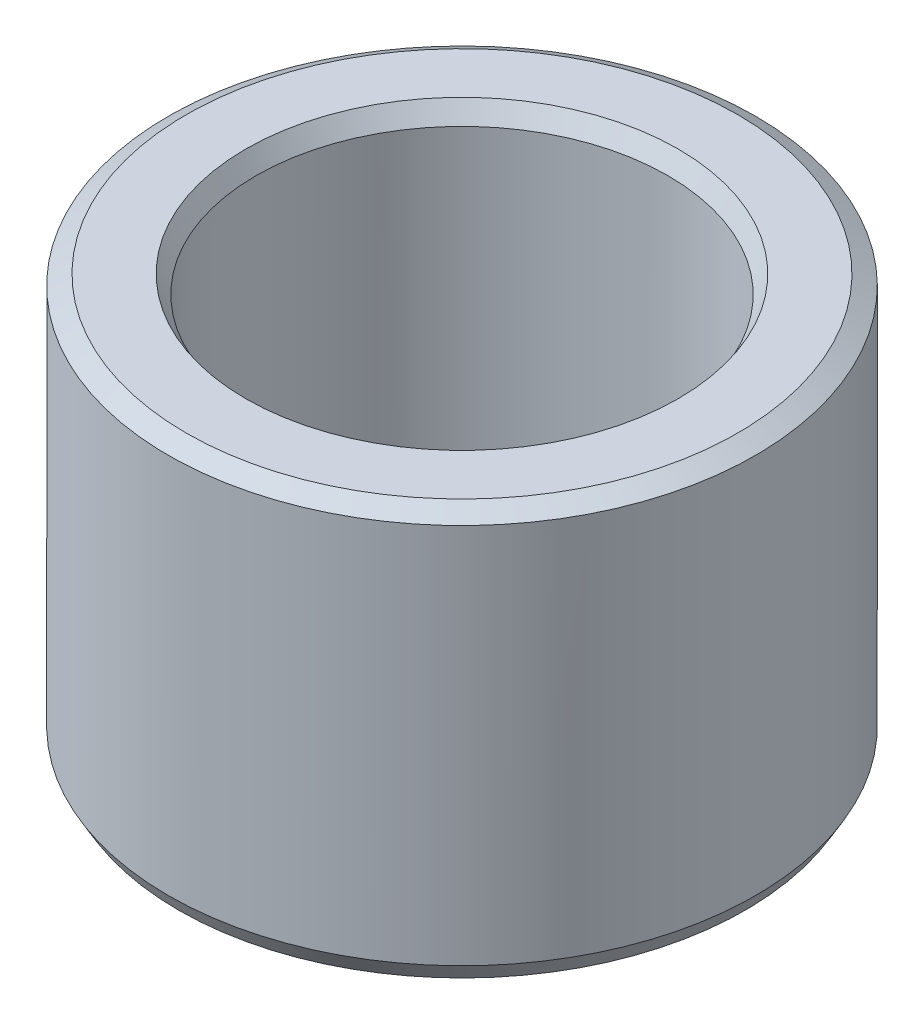
ISO-10303-21;
HEADER;
FILE_DESCRIPTION(('STEP AP214'),'2;1');
FILE_NAME('part.step','',(''),(''),'','','');
FILE_SCHEMA(('AUTOMOTIVE_DESIGN { 1 0 10303 214 1 1 1 1 }'));
ENDSEC;
DATA;
#1=APPLICATION_CONTEXT('core data for automotive mechanical design processes');
#2=APPLICATION_PROTOCOL_DEFINITION('international standard','automotive_design',2000,#1);
#3=PRODUCT_CONTEXT('',#1,'mechanical');
#4=PRODUCT('Part','Part','',(#3));
#5=PRODUCT_RELATED_PRODUCT_CATEGORY('part','',(#4));
#6=PRODUCT_DEFINITION_FORMATION('','',#4);
#7=PRODUCT_DEFINITION_CONTEXT('part definition',#1,'design');
#8=PRODUCT_DEFINITION('design','',#6,#7);
#9=PRODUCT_DEFINITION_SHAPE('','',#8);
#10=(LENGTH_UNIT() NAMED_UNIT(*) SI_UNIT(.MILLI.,.METRE.));
#11=(NAMED_UNIT(*) PLANE_ANGLE_UNIT() SI_UNIT($,.RADIAN.));
#12=(NAMED_UNIT(*) SI_UNIT($,.STERADIAN.) SOLID_ANGLE_UNIT());
#13=UNCERTAINTY_MEASURE_WITH_UNIT(LENGTH_MEASURE(1.E-05),#10,'distance_accuracy_value','');
#14=(GEOMETRIC_REPRESENTATION_CONTEXT(3) GLOBAL_UNCERTAINTY_ASSIGNED_CONTEXT((#13)) GLOBAL_UNIT_ASSIGNED_CONTEXT((#10,
#11,#12)) REPRESENTATION_CONTEXT('',''));
#15=CARTESIAN_POINT('',(0.,0.,0.));
#16=DIRECTION('',(0.,0.,1.));
#17=DIRECTION('',(1.,0.,0.));
#18=AXIS2_PLACEMENT_3D('',#15,#16,#17);
#19=CARTESIAN_POINT('',(0.,76.6838179556978,0.));
#20=DIRECTION('',(0.,-1.,0.));
#21=DIRECTION('',(0.,0.,-1.));
#22=AXIS2_PLACEMENT_3D('',#19,#20,#21);
#23=CYLINDRICAL_SURFACE('',#22,55.);
#24=CARTESIAN_POINT('',(0.,3.35095476548825,0.));
#25=DIRECTION('',(0.,1.,0.));
#26=DIRECTION('',(0.,0.,1.));
#27=AXIS2_PLACEMENT_3D('',#24,#25,#26);
#28=CIRCLE('',#27,55.);
#29=CARTESIAN_POINT('',(0.,3.35095476548825,55.));
#30=VERTEX_POINT('',#29);
#31=EDGE_CURVE('E10',#30,#30,#28,.T.);
#32=ORIENTED_EDGE('',*,*,#31,.T.);
#33=EDGE_LOOP('',(#32));
#34=FACE_BOUND('',#33,.T.);
#35=CARTESIAN_POINT('',(0.,74.7491433198009,0.));
#36=DIRECTION('',(0.,1.,0.));
#37=DIRECTION('',(0.,0.,1.));
#38=AXIS2_PLACEMENT_3D('',#35,#36,#37);
#39=CIRCLE('',#38,55.);
#40=CARTESIAN_POINT('',(0.,74.7491433198009,-55.));
#41=VERTEX_POINT('',#40);
#42=EDGE_CURVE('E50',#41,#41,#39,.F.);
#43=ORIENTED_EDGE('',*,*,#42,.T.);
#44=EDGE_LOOP('',(#43));
#45=FACE_BOUND('',#44,.T.);
#46=ADVANCED_FACE('F39',(#34,#45),#23,.T.);
#47=CARTESIAN_POINT('',(0.,76.6838179556978,0.));
#48=DIRECTION('',(0.,1.,0.));
#49=DIRECTION('',(0.,0.,1.));
#50=AXIS2_PLACEMENT_3D('',#47,#48,#49);
#51=PLANE('',#50);
#52=CARTESIAN_POINT('',(0.,76.6838179556978,0.));
#53=DIRECTION('',(0.,1.,0.));
#54=DIRECTION('',(0.,0.,1.));
#55=AXIS2_PLACEMENT_3D('',#52,#53,#54);
#56=CIRCLE('',#55,40.5009742766207);
#57=CARTESIAN_POINT('',(0.,76.6838179556978,40.5009742766207));
#58=VERTEX_POINT('',#57);
#59=EDGE_CURVE('E58',#58,#58,#56,.F.);
#60=ORIENTED_EDGE('',*,*,#59,.T.);
#61=EDGE_LOOP('',(#60));
#62=FACE_BOUND('',#61,.T.);
#63=CARTESIAN_POINT('',(0.,76.6838179556978,0.));
#64=DIRECTION('',(0.,1.,0.));
#65=DIRECTION('',(0.,0.,1.));
#66=AXIS2_PLACEMENT_3D('',#63,#64,#65);
#67=CIRCLE('',#66,51.6490452345117);
#68=CARTESIAN_POINT('',(0.,76.6838179556978,-51.6490452345117));
#69=VERTEX_POINT('',#68);
#70=EDGE_CURVE('E61',#69,#69,#67,.T.);
#71=ORIENTED_EDGE('',*,*,#70,.T.);
#72=EDGE_LOOP('',(#71));
#73=FACE_BOUND('',#72,.T.);
#74=ADVANCED_FACE('F88',(#62,#73),#51,.T.);
#75=CARTESIAN_POINT('',(0.,0.,0.));
#76=DIRECTION('',(0.,1.,0.));
#77=DIRECTION('',(0.,0.,1.));
#78=AXIS2_PLACEMENT_3D('',#75,#76,#77);
#79=PLANE('',#78);
#80=CARTESIAN_POINT('',(0.,0.,0.));
#81=DIRECTION('',(0.,1.,0.));
#82=DIRECTION('',(0.,0.,1.));
#83=AXIS2_PLACEMENT_3D('',#80,#81,#82);
#84=CIRCLE('',#83,41.917254406212);
#85=CARTESIAN_POINT('',(0.,0.,-41.917254406212));
#86=VERTEX_POINT('',#85);
#87=EDGE_CURVE('E51',#86,#86,#84,.T.);
#88=ORIENTED_EDGE('',*,*,#87,.T.);
#89=EDGE_LOOP('',(#88));
#90=FACE_BOUND('',#89,.T.);
#91=CARTESIAN_POINT('',(0.,0.,0.));
#92=DIRECTION('',(0.,1.,0.));
#93=DIRECTION('',(0.,0.,1.));
#94=AXIS2_PLACEMENT_3D('',#91,#92,#93);
#95=CIRCLE('',#94,53.0653253641031);
#96=CARTESIAN_POINT('',(0.,0.,53.0653253641031));
#97=VERTEX_POINT('',#96);
#98=EDGE_CURVE('E54',#97,#97,#95,.F.);
#99=ORIENTED_EDGE('',*,*,#98,.T.);
#100=EDGE_LOOP('',(#99));
#101=FACE_BOUND('',#100,.T.);
#102=ADVANCED_FACE('F83',(#90,#101),#79,.F.);
#103=CARTESIAN_POINT('',(0.,76.6838179556978,0.));
#104=DIRECTION('',(0.,-1.,0.));
#105=DIRECTION('',(0.,0.,-1.));
#106=AXIS2_PLACEMENT_3D('',#103,#104,#105);
#107=CYLINDRICAL_SURFACE('',#106,38.5662996407237);
#108=CARTESIAN_POINT('',(0.,73.3328631902095,0.));
#109=DIRECTION('',(0.,1.,0.));
#110=DIRECTION('',(0.,0.,1.));
#111=AXIS2_PLACEMENT_3D('',#108,#109,#110);
#112=CIRCLE('',#111,38.5662996407237);
#113=CARTESIAN_POINT('',(0.,73.3328631902095,38.5662996407237));
#114=VERTEX_POINT('',#113);
#115=EDGE_CURVE('E67',#114,#114,#112,.T.);
#116=ORIENTED_EDGE('',*,*,#115,.T.);
#117=EDGE_LOOP('',(#116));
#118=FACE_BOUND('',#117,.T.);
#119=CARTESIAN_POINT('',(0.,1.93467463589693,0.));
#120=DIRECTION('',(0.,1.,0.));
#121=DIRECTION('',(0.,0.,1.));
#122=AXIS2_PLACEMENT_3D('',#119,#120,#121);
#123=CIRCLE('',#122,38.5662996407237);
#124=CARTESIAN_POINT('',(0.,1.93467463589693,-38.5662996407237));
#125=VERTEX_POINT('',#124);
#126=EDGE_CURVE('E69',#125,#125,#123,.F.);
#127=ORIENTED_EDGE('',*,*,#126,.T.);
#128=EDGE_LOOP('',(#127));
#129=FACE_BOUND('',#128,.T.);
#130=ADVANCED_FACE('F71',(#118,#129),#107,.F.);
#131=CARTESIAN_POINT('',(0.,73.3328631902095,0.));
#132=DIRECTION('',(0.,1.,0.));
#133=DIRECTION('',(0.,0.,1.));
#134=AXIS2_PLACEMENT_3D('',#131,#132,#133);
#135=CONICAL_SURFACE('',#134,38.5662996407237,0.523598775598299);
#136=ORIENTED_EDGE('',*,*,#59,.F.);
#137=EDGE_LOOP('',(#136));
#138=FACE_BOUND('',#137,.T.);
#139=ORIENTED_EDGE('',*,*,#115,.F.);
#140=EDGE_LOOP('',(#139));
#141=FACE_BOUND('',#140,.T.);
#142=ADVANCED_FACE('F77',(#138,#141),#135,.F.);
#143=CARTESIAN_POINT('',(0.,0.,0.));
#144=DIRECTION('',(0.,-1.,0.));
#145=DIRECTION('',(0.,0.,-1.));
#146=AXIS2_PLACEMENT_3D('',#143,#144,#145);
#147=CONICAL_SURFACE('',#146,41.917254406212,1.04719755119659);
#148=CARTESIAN_POINT('',(0.,1.93467463589693,-38.5662996407237));
#149=CARTESIAN_POINT('',(0.,1.91452177510634,-38.6012054195309));
#150=CARTESIAN_POINT('',(0.,1.89436891431574,-38.636111198338));
#151=CARTESIAN_POINT('',(0.,1.85406319273456,-38.7059227559524));
#152=CARTESIAN_POINT('',(0.,1.83391033194396,-38.7408285347596));
#153=CARTESIAN_POINT('',(0.,1.79360461036278,-38.8106400923739));
#154=CARTESIAN_POINT('',(0.,1.77345174957219,-38.8455458711811));
#155=CARTESIAN_POINT('',(0.,1.733146027991,-38.9153574287954));
#156=CARTESIAN_POINT('',(0.,1.71299316720041,-38.9502632076026));
#157=CARTESIAN_POINT('',(0.,1.67268744561922,-39.0200747652169));
#158=CARTESIAN_POINT('',(0.,1.65253458482863,-39.0549805440241));
#159=CARTESIAN_POINT('',(0.,1.61222886324744,-39.1247921016384));
#160=CARTESIAN_POINT('',(0.,1.59207600245685,-39.1596978804456));
#161=CARTESIAN_POINT('',(0.,1.55177028087566,-39.2295094380599));
#162=CARTESIAN_POINT('',(0.,1.53161742008507,-39.2644152168671));
#163=CARTESIAN_POINT('',(0.,1.49131169850388,-39.3342267744814));
#164=CARTESIAN_POINT('',(0.,1.47115883771329,-39.3691325532886));
#165=CARTESIAN_POINT('',(0.,1.4308531161321,-39.4389441109029));
#166=CARTESIAN_POINT('',(0.,1.41070025534151,-39.4738498897101));
#167=CARTESIAN_POINT('',(0.,1.37039453376033,-39.5436614473244));
#168=CARTESIAN_POINT('',(0.,1.35024167296973,-39.5785672261316));
#169=CARTESIAN_POINT('',(0.,1.30993595138855,-39.648378783746));
#170=CARTESIAN_POINT('',(0.,1.28978309059795,-39.6832845625531));
#171=CARTESIAN_POINT('',(0.,1.24947736901677,-39.7530961201675));
#172=CARTESIAN_POINT('',(0.,1.22932450822617,-39.7880018989746));
#173=CARTESIAN_POINT('',(0.,1.18901878664499,-39.857813456589));
#174=CARTESIAN_POINT('',(0.,1.1688659258544,-39.8927192353962));
#175=CARTESIAN_POINT('',(0.,1.12856020427321,-39.9625307930105));
#176=CARTESIAN_POINT('',(0.,1.10840734348261,-39.9974365718177));
#177=CARTESIAN_POINT('',(0.,1.06810162190143,-40.067248129432));
#178=CARTESIAN_POINT('',(0.,1.04794876111084,-40.1021539082392));
#179=CARTESIAN_POINT('',(0.,1.00764303952965,-40.1719654658535));
#180=CARTESIAN_POINT('',(0.,0.987490178739058,-40.2068712446607));
#181=CARTESIAN_POINT('',(0.,0.947184457157871,-40.276682802275));
#182=CARTESIAN_POINT('',(0.,0.927031596367278,-40.3115885810822));
#183=CARTESIAN_POINT('',(0.,0.886725874786092,-40.3814001386965));
#184=CARTESIAN_POINT('',(0.,0.8665730139955,-40.4163059175037));
#185=CARTESIAN_POINT('',(0.,0.826267292414314,-40.486117475118));
#186=CARTESIAN_POINT('',(0.,0.806114431623721,-40.5210232539252));
#187=CARTESIAN_POINT('',(0.,0.765808710042534,-40.5908348115395));
#188=CARTESIAN_POINT('',(0.,0.745655849251941,-40.6257405903467));
#189=CARTESIAN_POINT('',(0.,0.705350127670755,-40.695552147961));
#190=CARTESIAN_POINT('',(0.,0.685197266880163,-40.7304579267682));
#191=CARTESIAN_POINT('',(0.,0.644891545298977,-40.8002694843825));
#192=CARTESIAN_POINT('',(0.,0.624738684508384,-40.8351752631897));
#193=CARTESIAN_POINT('',(0.,0.584432962927197,-40.9049868208041));
#194=CARTESIAN_POINT('',(0.,0.564280102136604,-40.9398925996112));
#195=CARTESIAN_POINT('',(0.,0.523974380555418,-41.0097041572256));
#196=CARTESIAN_POINT('',(0.,0.503821519764826,-41.0446099360327));
#197=CARTESIAN_POINT('',(0.,0.46351579818364,-41.1144214936471));
#198=CARTESIAN_POINT('',(0.,0.443362937393046,-41.1493272724542));
#199=CARTESIAN_POINT('',(0.,0.40305721581186,-41.2191388300686));
#200=CARTESIAN_POINT('',(0.,0.382904355021267,-41.2540446088758));
#201=CARTESIAN_POINT('',(0.,0.342598633440081,-41.3238561664901));
#202=CARTESIAN_POINT('',(0.,0.322445772649488,-41.3587619452973));
#203=CARTESIAN_POINT('',(0.,0.282140051068302,-41.4285735029116));
#204=CARTESIAN_POINT('',(0.,0.26198719027771,-41.4634792817188));
#205=CARTESIAN_POINT('',(0.,0.221681468696524,-41.5332908393331));
#206=CARTESIAN_POINT('',(0.,0.20152860790593,-41.5681966181403));
#207=CARTESIAN_POINT('',(0.,0.161222886324744,-41.6380081757546));
#208=CARTESIAN_POINT('',(0.,0.141070025534151,-41.6729139545618));
#209=CARTESIAN_POINT('',(0.,0.100764303952965,-41.7427255121761));
#210=CARTESIAN_POINT('',(0.,0.0806114431623721,-41.7776312909833));
#211=CARTESIAN_POINT('',(0.,0.040305721581187,-41.8474428485976));
#212=CARTESIAN_POINT('',(0.,0.0201528607905944,-41.8823486274048));
#213=CARTESIAN_POINT('',(0.,0.,-41.917254406212));
#214=B_SPLINE_CURVE_WITH_KNOTS('',3,(#148,#149,#150,#151,#152,#153,#154,#155,#156,#157,#158,
#159,#160,#161,#162,#163,#164,#165,#166,#167,#168,#169,#170,#171,#172,#173,#174,#175,#176,#177,
#178,#179,#180,#181,#182,#183,#184,#185,#186,#187,#188,#189,#190,#191,#192,#193,#194,#195,#196,
#197,#198,#199,#200,#201,#202,#203,#204,#205,#206,#207,#208,#209,#210,#211,#212,#213),
.UNSPECIFIED.,.F.,.F.,(4,2,2,2,2,2,2,2,2,2,2,2,2,2,2,2,2,2,2,2,2,2,2,2,2,2,2,2,2,2,2,2,4),(0.,
0.120917164743555,0.241834329487116,0.362751494230671,0.483668658974226,0.604585823717788,
0.725502988461343,0.846420153204898,0.967337317948453,1.08825448269201,1.20917164743557,
1.33008881217912,1.45100597692269,1.57192314166624,1.6928403064098,1.81375747115336,
1.93467463589691,2.05559180064047,2.17650896538403,2.29742613012758,2.41834329487114,
2.5392604596147,2.66017762435825,2.78109478910181,2.90201195384537,3.02292911858893,
3.14384628333248,3.26476344807604,3.3856806128196,3.50659777756315,3.62751494230671,
3.74843210705027,3.86934927179382),.UNSPECIFIED.);
#215=EDGE_CURVE('BSEAM73',#125,#86,#214,.T.);
#216=ORIENTED_EDGE('',*,*,#126,.F.);
#217=ORIENTED_EDGE('',*,*,#87,.F.);
#218=ORIENTED_EDGE('',*,*,#215,.T.);
#219=ORIENTED_EDGE('',*,*,#215,.F.);
#220=EDGE_LOOP('',(#216,#218,#217,#219));
#221=FACE_BOUND('',#220,.T.);
#222=ADVANCED_FACE('F73',(#221),#147,.F.);
#223=CARTESIAN_POINT('',(0.,3.35095476548825,0.));
#224=DIRECTION('',(0.,1.,0.));
#225=DIRECTION('',(0.,0.,1.));
#226=AXIS2_PLACEMENT_3D('',#223,#224,#225);
#227=CONICAL_SURFACE('',#226,55.,0.523598775598301);
#228=ORIENTED_EDGE('',*,*,#98,.F.);
#229=EDGE_LOOP('',(#228));
#230=FACE_BOUND('',#229,.T.);
#231=ORIENTED_EDGE('',*,*,#31,.F.);
#232=EDGE_LOOP('',(#231));
#233=FACE_BOUND('',#232,.T.);
#234=ADVANCED_FACE('F76',(#230,#233),#227,.T.);
#235=CARTESIAN_POINT('',(0.,76.6838179556978,0.));
#236=DIRECTION('',(0.,-1.,0.));
#237=DIRECTION('',(0.,0.,-1.));
#238=AXIS2_PLACEMENT_3D('',#235,#236,#237);
#239=CONICAL_SURFACE('',#238,51.6490452345117,1.04719755119659);
#240=CARTESIAN_POINT('',(0.,74.7491433198009,-55.));
#241=CARTESIAN_POINT('',(0.,74.7692961805915,-54.9650942211928));
#242=CARTESIAN_POINT('',(0.,74.7894490413821,-54.9301884423857));
#243=CARTESIAN_POINT('',(0.,74.8297547629633,-54.8603768847713));
#244=CARTESIAN_POINT('',(0.,74.8499076237539,-54.8254711059642));
#245=CARTESIAN_POINT('',(0.,74.890213345335,-54.7556595483498));
#246=CARTESIAN_POINT('',(0.,74.9103662061256,-54.7207537695427));
#247=CARTESIAN_POINT('',(0.,74.9506719277068,-54.6509422119283));
#248=CARTESIAN_POINT('',(0.,74.9708247884974,-54.6160364331212));
#249=CARTESIAN_POINT('',(0.,75.0111305100786,-54.5462248755068));
#250=CARTESIAN_POINT('',(0.,75.0312833708692,-54.5113190966996));
#251=CARTESIAN_POINT('',(0.,75.0715890924504,-54.4415075390853));
#252=CARTESIAN_POINT('',(0.,75.091741953241,-54.4066017602781));
#253=CARTESIAN_POINT('',(0.,75.1320476748221,-54.3367902026638));
#254=CARTESIAN_POINT('',(0.,75.1522005356127,-54.3018844238566));
#255=CARTESIAN_POINT('',(0.,75.1925062571939,-54.2320728662423));
#256=CARTESIAN_POINT('',(0.,75.2126591179845,-54.1971670874351));
#257=CARTESIAN_POINT('',(0.,75.2529648395657,-54.1273555298208));
#258=CARTESIAN_POINT('',(0.,75.2731177003563,-54.0924497510136));
#259=CARTESIAN_POINT('',(0.,75.3134234219375,-54.0226381933993));
#260=CARTESIAN_POINT('',(0.,75.3335762827281,-53.9877324145921));
#261=CARTESIAN_POINT('',(0.,75.3738820043093,-53.9179208569778));
#262=CARTESIAN_POINT('',(0.,75.3940348650999,-53.8830150781706));
#263=CARTESIAN_POINT('',(0.,75.4343405866811,-53.8132035205563));
#264=CARTESIAN_POINT('',(0.,75.4544934474716,-53.7782977417491));
#265=CARTESIAN_POINT('',(0.,75.4947991690528,-53.7084861841347));
#266=CARTESIAN_POINT('',(0.,75.5149520298434,-53.6735804053276));
#267=CARTESIAN_POINT('',(0.,75.5552577514246,-53.6037688477132));
#268=CARTESIAN_POINT('',(0.,75.5754106122152,-53.5688630689061));
#269=CARTESIAN_POINT('',(0.,75.6157163337964,-53.4990515112917));
#270=CARTESIAN_POINT('',(0.,75.635869194587,-53.4641457324846));
#271=CARTESIAN_POINT('',(0.,75.6761749161682,-53.3943341748702));
#272=CARTESIAN_POINT('',(0.,75.6963277769588,-53.359428396063));
#273=CARTESIAN_POINT('',(0.,75.7366334985399,-53.2896168384487));
#274=CARTESIAN_POINT('',(0.,75.7567863593305,-53.2547110596415));
#275=CARTESIAN_POINT('',(0.,75.7970920809117,-53.1848995020272));
#276=CARTESIAN_POINT('',(0.,75.8172449417023,-53.14999372322));
#277=CARTESIAN_POINT('',(0.,75.8575506632835,-53.0801821656057));
#278=CARTESIAN_POINT('',(0.,75.8777035240741,-53.0452763867985));
#279=CARTESIAN_POINT('',(0.,75.9180092456553,-52.9754648291842));
#280=CARTESIAN_POINT('',(0.,75.9381621064459,-52.940559050377));
#281=CARTESIAN_POINT('',(0.,75.9784678280271,-52.8707474927627));
#282=CARTESIAN_POINT('',(0.,75.9986206888176,-52.8358417139555));
#283=CARTESIAN_POINT('',(0.,76.0389264103988,-52.7660301563412));
#284=CARTESIAN_POINT('',(0.,76.0590792711894,-52.731124377534));
#285=CARTESIAN_POINT('',(0.,76.0993849927706,-52.6613128199197));
#286=CARTESIAN_POINT('',(0.,76.1195378535612,-52.6264070411125));
#287=CARTESIAN_POINT('',(0.,76.1598435751424,-52.5565954834981));
#288=CARTESIAN_POINT('',(0.,76.179996435933,-52.521689704691));
#289=CARTESIAN_POINT('',(0.,76.2203021575142,-52.4518781470766));
#290=CARTESIAN_POINT('',(0.,76.2404550183048,-52.4169723682695));
#291=CARTESIAN_POINT('',(0.,76.280760739886,-52.3471608106551));
#292=CARTESIAN_POINT('',(0.,76.3009136006766,-52.312255031848));
#293=CARTESIAN_POINT('',(0.,76.3412193222577,-52.2424434742336));
#294=CARTESIAN_POINT('',(0.,76.3613721830483,-52.2075376954264));
#295=CARTESIAN_POINT('',(0.,76.4016779046295,-52.1377261378121));
#296=CARTESIAN_POINT('',(0.,76.4218307654201,-52.1028203590049));
#297=CARTESIAN_POINT('',(0.,76.4621364870013,-52.0330088013906));
#298=CARTESIAN_POINT('',(0.,76.4822893477919,-51.9981030225834));
#299=CARTESIAN_POINT('',(0.,76.5225950693731,-51.9282914649691));
#300=CARTESIAN_POINT('',(0.,76.5427479301637,-51.8933856861619));
#301=CARTESIAN_POINT('',(0.,76.5830536517448,-51.8235741285476));
#302=CARTESIAN_POINT('',(0.,76.6032065125355,-51.7886683497404));
#303=CARTESIAN_POINT('',(0.,76.6435122341166,-51.7188567921261));
#304=CARTESIAN_POINT('',(0.,76.6636650949072,-51.6839510133189));
#305=CARTESIAN_POINT('',(0.,76.6838179556978,-51.6490452345117));
#306=B_SPLINE_CURVE_WITH_KNOTS('',3,(#240,#241,#242,#243,#244,#245,#246,#247,#248,#249,#250,
#251,#252,#253,#254,#255,#256,#257,#258,#259,#260,#261,#262,#263,#264,#265,#266,#267,#268,#269,
#270,#271,#272,#273,#274,#275,#276,#277,#278,#279,#280,#281,#282,#283,#284,#285,#286,#287,#288,
#289,#290,#291,#292,#293,#294,#295,#296,#297,#298,#299,#300,#301,#302,#303,#304,#305),
.UNSPECIFIED.,.F.,.F.,(4,2,2,2,2,2,2,2,2,2,2,2,2,2,2,2,2,2,2,2,2,2,2,2,2,2,2,2,2,2,2,2,4),(0.,
0.120917164743566,0.241834329487119,0.362751494230672,0.483668658974238,0.604585823717792,
0.725502988461351,0.846420153204904,0.967337317948464,1.08825448269202,1.20917164743558,
1.33008881217914,1.4510059769227,1.57192314166625,1.69284030640981,1.81375747115337,
1.93467463589693,2.05559180064048,2.17650896538405,2.2974261301276,2.41834329487115,
2.53926045961471,2.66017762435827,2.78109478910183,2.90201195384538,3.02292911858894,
3.1438462833325,3.26476344807606,3.38568061281962,3.50659777756318,3.62751494230673,
3.74843210705029,3.86934927179385),.UNSPECIFIED.);
#307=EDGE_CURVE('BSEAM45',#41,#69,#306,.T.);
#308=ORIENTED_EDGE('',*,*,#42,.F.);
#309=ORIENTED_EDGE('',*,*,#70,.F.);
#310=ORIENTED_EDGE('',*,*,#307,.T.);
#311=ORIENTED_EDGE('',*,*,#307,.F.);
#312=EDGE_LOOP('',(#308,#310,#309,#311));
#313=FACE_BOUND('',#312,.T.);
#314=ADVANCED_FACE('F45',(#313),#239,.T.);
#315=CLOSED_SHELL('',(#46,#74,#102,#130,#142,#222,#234,#314));
#316=MANIFOLD_SOLID_BREP('B2',#315);
#317=ADVANCED_BREP_SHAPE_REPRESENTATION('',(#18,#316),#14);
#318=SHAPE_DEFINITION_REPRESENTATION(#9,#317);
ENDSEC;
END-ISO-10303-21;
